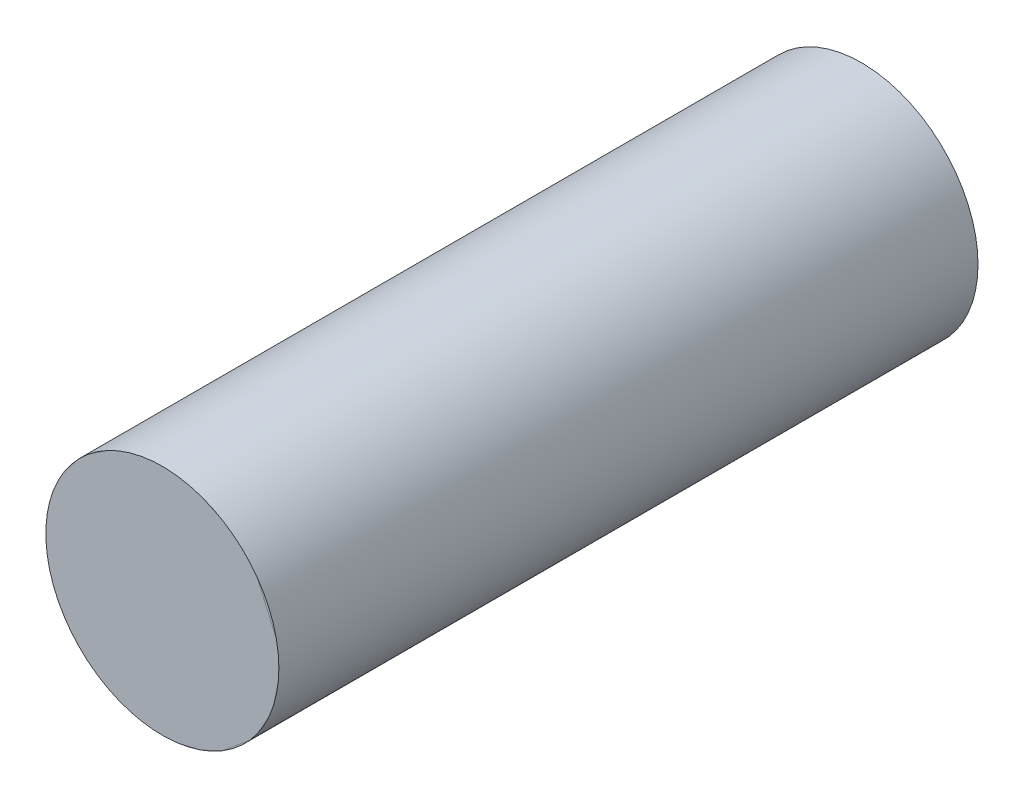
ISO-10303-21;
HEADER;
FILE_DESCRIPTION(('STEP AP214'),'2;1');
FILE_NAME('part.step','',(''),(''),'','','');
FILE_SCHEMA(('AUTOMOTIVE_DESIGN { 1 0 10303 214 1 1 1 1 }'));
ENDSEC;
DATA;
#1=APPLICATION_CONTEXT('core data for automotive mechanical design processes');
#2=APPLICATION_PROTOCOL_DEFINITION('international standard','automotive_design',2000,#1);
#3=PRODUCT_CONTEXT('',#1,'mechanical');
#4=PRODUCT('Part','Part','',(#3));
#5=PRODUCT_RELATED_PRODUCT_CATEGORY('part','',(#4));
#6=PRODUCT_DEFINITION_FORMATION('','',#4);
#7=PRODUCT_DEFINITION_CONTEXT('part definition',#1,'design');
#8=PRODUCT_DEFINITION('design','',#6,#7);
#9=PRODUCT_DEFINITION_SHAPE('','',#8);
#10=(LENGTH_UNIT() NAMED_UNIT(*) SI_UNIT(.MILLI.,.METRE.));
#11=(NAMED_UNIT(*) PLANE_ANGLE_UNIT() SI_UNIT($,.RADIAN.));
#12=(NAMED_UNIT(*) SI_UNIT($,.STERADIAN.) SOLID_ANGLE_UNIT());
#13=UNCERTAINTY_MEASURE_WITH_UNIT(LENGTH_MEASURE(1.E-05),#10,'distance_accuracy_value','');
#14=(GEOMETRIC_REPRESENTATION_CONTEXT(3) GLOBAL_UNCERTAINTY_ASSIGNED_CONTEXT((#13)) GLOBAL_UNIT_ASSIGNED_CONTEXT((#10,
#11,#12)) REPRESENTATION_CONTEXT('',''));
#15=CARTESIAN_POINT('',(0.,0.,0.));
#16=DIRECTION('',(0.,0.,1.));
#17=DIRECTION('',(1.,0.,0.));
#18=AXIS2_PLACEMENT_3D('',#15,#16,#17);
#19=CARTESIAN_POINT('',(-205.237767720353,-94.9477839792411,-11.8));
#20=DIRECTION('',(0.,0.,1.));
#21=DIRECTION('',(1.,0.,0.));
#22=AXIS2_PLACEMENT_3D('',#19,#20,#21);
#23=CYLINDRICAL_SURFACE('',#22,0.300000000000013);
#24=CARTESIAN_POINT('',(-205.237767720353,-94.9477839792411,-11.8));
#25=DIRECTION('',(0.,0.,1.));
#26=DIRECTION('',(1.,0.,0.));
#27=AXIS2_PLACEMENT_3D('',#24,#25,#26);
#28=CIRCLE('',#27,0.300000000000013);
#29=CARTESIAN_POINT('',(-204.937767720353,-94.9477839792411,-11.8));
#30=VERTEX_POINT('',#29);
#31=EDGE_CURVE('E11',#30,#30,#28,.T.);
#32=ORIENTED_EDGE('',*,*,#31,.T.);
#33=EDGE_LOOP('',(#32));
#34=FACE_BOUND('',#33,.T.);
#35=CARTESIAN_POINT('',(-205.237767720353,-94.9477839792411,-9.99999999999999));
#36=DIRECTION('',(0.,0.,1.));
#37=DIRECTION('',(1.,0.,0.));
#38=AXIS2_PLACEMENT_3D('',#35,#36,#37);
#39=CIRCLE('',#38,0.300000000000013);
#40=CARTESIAN_POINT('',(-204.937767720353,-94.9477839792411,-9.99999999999999));
#41=VERTEX_POINT('',#40);
#42=EDGE_CURVE('E46',#41,#41,#39,.T.);
#43=ORIENTED_EDGE('',*,*,#42,.F.);
#44=EDGE_LOOP('',(#43));
#45=FACE_BOUND('',#44,.T.);
#46=ADVANCED_FACE('F43',(#34,#45),#23,.T.);
#47=CARTESIAN_POINT('',(-205.237767720353,-94.9477839792411,-11.8));
#48=DIRECTION('',(0.,0.,1.));
#49=DIRECTION('',(1.,0.,0.));
#50=AXIS2_PLACEMENT_3D('',#47,#48,#49);
#51=PLANE('',#50);
#52=ORIENTED_EDGE('',*,*,#31,.F.);
#53=EDGE_LOOP('',(#52));
#54=FACE_BOUND('',#53,.T.);
#55=ADVANCED_FACE('F58',(#54),#51,.F.);
#56=CARTESIAN_POINT('',(-205.237767720353,-94.9477839792411,-9.99999999999999));
#57=DIRECTION('',(0.,0.,1.));
#58=DIRECTION('',(1.,0.,0.));
#59=AXIS2_PLACEMENT_3D('',#56,#57,#58);
#60=PLANE('',#59);
#61=ORIENTED_EDGE('',*,*,#42,.T.);
#62=EDGE_LOOP('',(#61));
#63=FACE_BOUND('',#62,.T.);
#64=ADVANCED_FACE('F55',(#63),#60,.T.);
#65=CLOSED_SHELL('',(#46,#55,#64));
#66=MANIFOLD_SOLID_BREP('B2',#65);
#67=CARTESIAN_POINT('',(-205.237767720353,-94.9477839792411,-9.99999999999999));
#68=DIRECTION('',(0.,0.,1.));
#69=DIRECTION('',(1.,0.,0.));
#70=AXIS2_PLACEMENT_3D('',#67,#68,#69);
#71=PLANE('',#70);
#72=CARTESIAN_POINT('',(-205.237767720353,-94.9477839792411,-9.99999999999999));
#73=DIRECTION('',(0.,0.,1.));
#74=DIRECTION('',(1.,0.,0.));
#75=AXIS2_PLACEMENT_3D('',#72,#73,#74);
#76=CIRCLE('',#75,0.300000000000022);
#77=CARTESIAN_POINT('',(-204.937767720353,-94.9477839792411,-9.99999999999999));
#78=VERTEX_POINT('',#77);
#79=EDGE_CURVE('E42',#78,#78,#76,.F.);
#80=ORIENTED_EDGE('',*,*,#79,.F.);
#81=EDGE_LOOP('',(#80));
#82=FACE_BOUND('',#81,.T.);
#83=ADVANCED_FACE('F83',(#82),#71,.T.);
#84=OPEN_SHELL('',(#83));
#85=SHELL_BASED_SURFACE_MODEL('B6',(#84));
#86=ADVANCED_BREP_SHAPE_REPRESENTATION('',(#18,#66),#14);
#87=MANIFOLD_SURFACE_SHAPE_REPRESENTATION('',(#18,#85),#14);
#88=SHAPE_REPRESENTATION('',(#18),#14);
#89=SHAPE_DEFINITION_REPRESENTATION(#9,#88);
#90=SHAPE_REPRESENTATION_RELATIONSHIP('','',#88,#86);
#91=SHAPE_REPRESENTATION_RELATIONSHIP('','',#88,#87);
ENDSEC;
END-ISO-10303-21;
